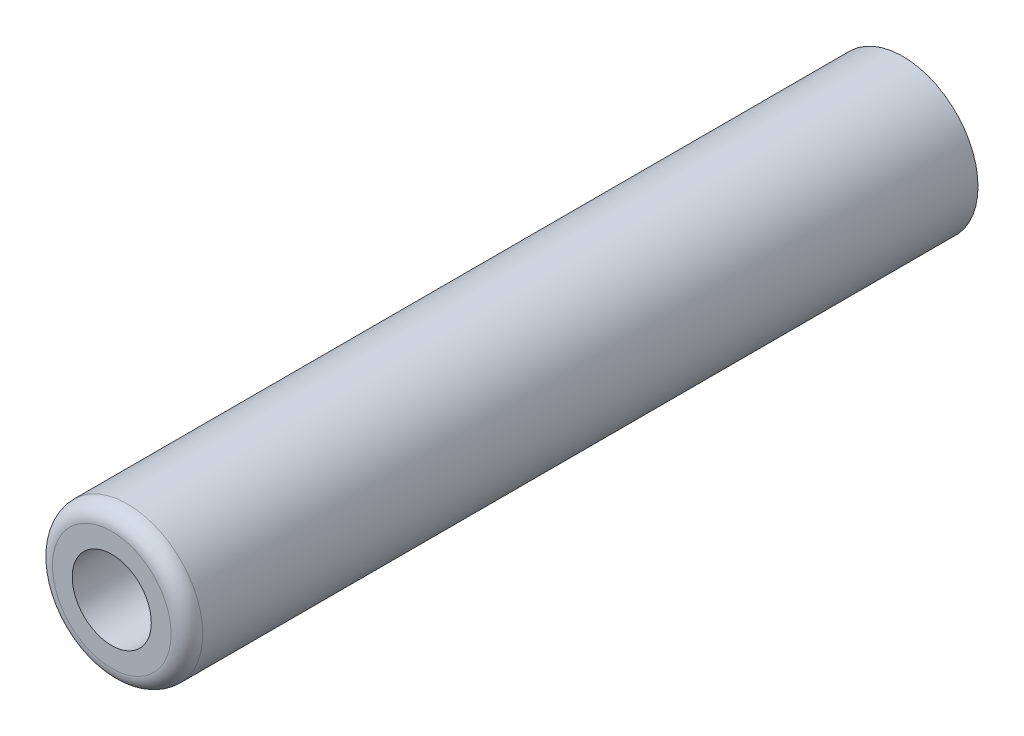
ISO-10303-21;
HEADER;
FILE_DESCRIPTION(('STEP AP214'),'2;1');
FILE_NAME('part.step','',(''),(''),'','','');
FILE_SCHEMA(('AUTOMOTIVE_DESIGN { 1 0 10303 214 1 1 1 1 }'));
ENDSEC;
DATA;
#1=APPLICATION_CONTEXT('core data for automotive mechanical design processes');
#2=APPLICATION_PROTOCOL_DEFINITION('international standard','automotive_design',2000,#1);
#3=PRODUCT_CONTEXT('',#1,'mechanical');
#4=PRODUCT('Part','Part','',(#3));
#5=PRODUCT_RELATED_PRODUCT_CATEGORY('part','',(#4));
#6=PRODUCT_DEFINITION_FORMATION('','',#4);
#7=PRODUCT_DEFINITION_CONTEXT('part definition',#1,'design');
#8=PRODUCT_DEFINITION('design','',#6,#7);
#9=PRODUCT_DEFINITION_SHAPE('','',#8);
#10=(LENGTH_UNIT() NAMED_UNIT(*) SI_UNIT(.MILLI.,.METRE.));
#11=(NAMED_UNIT(*) PLANE_ANGLE_UNIT() SI_UNIT($,.RADIAN.));
#12=(NAMED_UNIT(*) SI_UNIT($,.STERADIAN.) SOLID_ANGLE_UNIT());
#13=UNCERTAINTY_MEASURE_WITH_UNIT(LENGTH_MEASURE(1.E-05),#10,'distance_accuracy_value','');
#14=(GEOMETRIC_REPRESENTATION_CONTEXT(3) GLOBAL_UNCERTAINTY_ASSIGNED_CONTEXT((#13)) GLOBAL_UNIT_ASSIGNED_CONTEXT((#10,
#11,#12)) REPRESENTATION_CONTEXT('',''));
#15=CARTESIAN_POINT('',(0.,0.,0.));
#16=DIRECTION('',(0.,0.,1.));
#17=DIRECTION('',(1.,0.,0.));
#18=AXIS2_PLACEMENT_3D('',#15,#16,#17);
#19=CARTESIAN_POINT('',(0.,0.,20.));
#20=DIRECTION('',(0.,0.,-1.));
#21=DIRECTION('',(-1.,0.,0.));
#22=AXIS2_PLACEMENT_3D('',#19,#20,#21);
#23=CYLINDRICAL_SURFACE('',#22,3.8);
#24=CARTESIAN_POINT('',(0.,0.,19.2));
#25=DIRECTION('',(0.,0.,1.));
#26=DIRECTION('',(1.,0.,0.));
#27=AXIS2_PLACEMENT_3D('',#24,#25,#26);
#28=CIRCLE('',#27,3.8);
#29=CARTESIAN_POINT('',(3.8,0.,19.2));
#30=VERTEX_POINT('',#29);
#31=EDGE_CURVE('E10',#30,#30,#28,.F.);
#32=ORIENTED_EDGE('',*,*,#31,.T.);
#33=EDGE_LOOP('',(#32));
#34=FACE_BOUND('',#33,.T.);
#35=CARTESIAN_POINT('',(0.,0.,-20.));
#36=DIRECTION('',(0.,0.,1.));
#37=DIRECTION('',(1.,0.,0.));
#38=AXIS2_PLACEMENT_3D('',#35,#36,#37);
#39=CIRCLE('',#38,3.8);
#40=CARTESIAN_POINT('',(3.8,0.,-20.));
#41=VERTEX_POINT('',#40);
#42=EDGE_CURVE('E43',#41,#41,#39,.T.);
#43=ORIENTED_EDGE('',*,*,#42,.T.);
#44=EDGE_LOOP('',(#43));
#45=FACE_BOUND('',#44,.T.);
#46=ADVANCED_FACE('F32',(#34,#45),#23,.T.);
#47=CARTESIAN_POINT('',(0.,0.,20.));
#48=DIRECTION('',(0.,0.,1.));
#49=DIRECTION('',(1.,0.,0.));
#50=AXIS2_PLACEMENT_3D('',#47,#48,#49);
#51=PLANE('',#50);
#52=CARTESIAN_POINT('',(0.,0.,20.));
#53=DIRECTION('',(0.,0.,1.));
#54=DIRECTION('',(1.,0.,0.));
#55=AXIS2_PLACEMENT_3D('',#52,#53,#54);
#56=CIRCLE('',#55,3.);
#57=CARTESIAN_POINT('',(3.,0.,20.));
#58=VERTEX_POINT('',#57);
#59=EDGE_CURVE('E39',#58,#58,#56,.T.);
#60=ORIENTED_EDGE('',*,*,#59,.T.);
#61=EDGE_LOOP('',(#60));
#62=FACE_BOUND('',#61,.T.);
#63=CARTESIAN_POINT('',(0.,0.,20.));
#64=DIRECTION('',(0.,0.,1.));
#65=DIRECTION('',(1.,0.,0.));
#66=AXIS2_PLACEMENT_3D('',#63,#64,#65);
#67=CIRCLE('',#66,2.);
#68=CARTESIAN_POINT('',(2.,0.,20.));
#69=VERTEX_POINT('',#68);
#70=EDGE_CURVE('E52',#69,#69,#67,.T.);
#71=ORIENTED_EDGE('',*,*,#70,.F.);
#72=EDGE_LOOP('',(#71));
#73=FACE_BOUND('',#72,.T.);
#74=ADVANCED_FACE('F58',(#62,#73),#51,.T.);
#75=CARTESIAN_POINT('',(0.,0.,-20.));
#76=DIRECTION('',(0.,0.,1.));
#77=DIRECTION('',(1.,0.,0.));
#78=AXIS2_PLACEMENT_3D('',#75,#76,#77);
#79=PLANE('',#78);
#80=CARTESIAN_POINT('',(0.,0.,-20.));
#81=DIRECTION('',(0.,0.,1.));
#82=DIRECTION('',(1.,0.,0.));
#83=AXIS2_PLACEMENT_3D('',#80,#81,#82);
#84=CIRCLE('',#83,2.);
#85=CARTESIAN_POINT('',(2.,0.,-20.));
#86=VERTEX_POINT('',#85);
#87=EDGE_CURVE('E47',#86,#86,#84,.T.);
#88=ORIENTED_EDGE('',*,*,#87,.T.);
#89=EDGE_LOOP('',(#88));
#90=FACE_BOUND('',#89,.T.);
#91=ORIENTED_EDGE('',*,*,#42,.F.);
#92=EDGE_LOOP('',(#91));
#93=FACE_BOUND('',#92,.T.);
#94=ADVANCED_FACE('F60',(#90,#93),#79,.F.);
#95=CARTESIAN_POINT('',(0.,0.,-20.));
#96=DIRECTION('',(0.,0.,1.));
#97=DIRECTION('',(1.,0.,0.));
#98=AXIS2_PLACEMENT_3D('',#95,#96,#97);
#99=CYLINDRICAL_SURFACE('',#98,2.);
#100=ORIENTED_EDGE('',*,*,#87,.F.);
#101=EDGE_LOOP('',(#100));
#102=FACE_BOUND('',#101,.T.);
#103=ORIENTED_EDGE('',*,*,#70,.T.);
#104=EDGE_LOOP('',(#103));
#105=FACE_BOUND('',#104,.T.);
#106=ADVANCED_FACE('F56',(#102,#105),#99,.F.);
#107=CARTESIAN_POINT('',(0.,0.,19.2));
#108=DIRECTION('',(0.,0.,1.));
#109=DIRECTION('',(1.,0.,0.));
#110=AXIS2_PLACEMENT_3D('',#107,#108,#109);
#111=TOROIDAL_SURFACE('',#110,3.,0.8);
#112=ORIENTED_EDGE('',*,*,#31,.F.);
#113=EDGE_LOOP('',(#112));
#114=FACE_BOUND('',#113,.T.);
#115=ORIENTED_EDGE('',*,*,#59,.F.);
#116=EDGE_LOOP('',(#115));
#117=FACE_BOUND('',#116,.T.);
#118=ADVANCED_FACE('F34',(#114,#117),#111,.T.);
#119=CLOSED_SHELL('',(#46,#74,#94,#106,#118));
#120=MANIFOLD_SOLID_BREP('B2',#119);
#121=ADVANCED_BREP_SHAPE_REPRESENTATION('',(#18,#120),#14);
#122=SHAPE_DEFINITION_REPRESENTATION(#9,#121);
ENDSEC;
END-ISO-10303-21;
